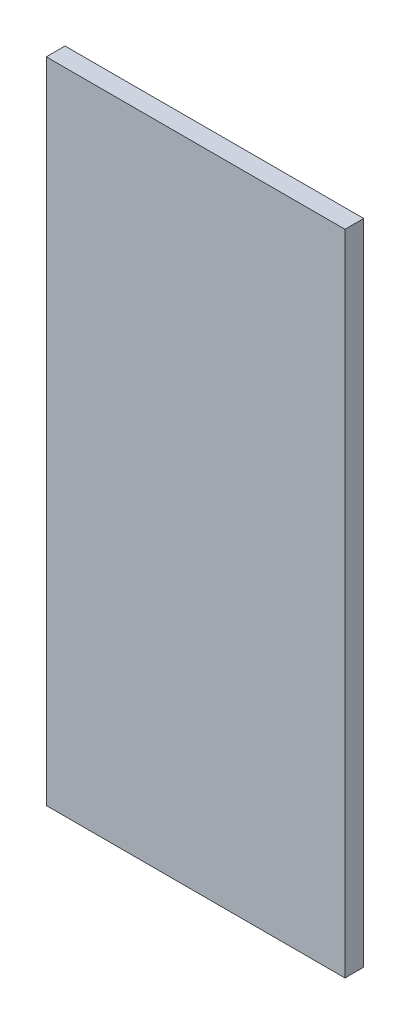
ISO-10303-21;
HEADER;
FILE_DESCRIPTION(('STEP AP214'),'2;1');
FILE_NAME('part.step','',(''),(''),'','','');
FILE_SCHEMA(('AUTOMOTIVE_DESIGN { 1 0 10303 214 1 1 1 1 }'));
ENDSEC;
DATA;
#1=APPLICATION_CONTEXT('core data for automotive mechanical design processes');
#2=APPLICATION_PROTOCOL_DEFINITION('international standard','automotive_design',2000,#1);
#3=PRODUCT_CONTEXT('',#1,'mechanical');
#4=PRODUCT('Part','Part','',(#3));
#5=PRODUCT_RELATED_PRODUCT_CATEGORY('part','',(#4));
#6=PRODUCT_DEFINITION_FORMATION('','',#4);
#7=PRODUCT_DEFINITION_CONTEXT('part definition',#1,'design');
#8=PRODUCT_DEFINITION('design','',#6,#7);
#9=PRODUCT_DEFINITION_SHAPE('','',#8);
#10=(LENGTH_UNIT() NAMED_UNIT(*) SI_UNIT(.MILLI.,.METRE.));
#11=(NAMED_UNIT(*) PLANE_ANGLE_UNIT() SI_UNIT($,.RADIAN.));
#12=(NAMED_UNIT(*) SI_UNIT($,.STERADIAN.) SOLID_ANGLE_UNIT());
#13=UNCERTAINTY_MEASURE_WITH_UNIT(LENGTH_MEASURE(1.E-05),#10,'distance_accuracy_value','');
#14=(GEOMETRIC_REPRESENTATION_CONTEXT(3) GLOBAL_UNCERTAINTY_ASSIGNED_CONTEXT((#13)) GLOBAL_UNIT_ASSIGNED_CONTEXT((#10,
#11,#12)) REPRESENTATION_CONTEXT('',''));
#15=CARTESIAN_POINT('',(0.,0.,0.));
#16=DIRECTION('',(0.,0.,1.));
#17=DIRECTION('',(1.,0.,0.));
#18=AXIS2_PLACEMENT_3D('',#15,#16,#17);
#19=CARTESIAN_POINT('',(-143.5,-311.5,18.));
#20=DIRECTION('',(1.,0.,0.));
#21=DIRECTION('',(0.,0.,-1.));
#22=AXIS2_PLACEMENT_3D('',#19,#20,#21);
#23=PLANE('',#22);
#24=DIRECTION('',(0.,-1.,0.));
#25=VECTOR('',#24,1.);
#26=CARTESIAN_POINT('',(-143.5,-311.5,0.));
#27=LINE('',#26,#25);
#28=CARTESIAN_POINT('',(-143.5,311.5,0.));
#29=VERTEX_POINT('',#28);
#30=CARTESIAN_POINT('',(-143.5,-311.5,0.));
#31=VERTEX_POINT('',#30);
#32=EDGE_CURVE('E96',#29,#31,#27,.T.);
#33=ORIENTED_EDGE('',*,*,#32,.T.);
#34=DIRECTION('',(0.,0.,-1.));
#35=VECTOR('',#34,1.);
#36=CARTESIAN_POINT('',(-143.5,-311.5,18.));
#37=LINE('',#36,#35);
#38=CARTESIAN_POINT('',(-143.5,-311.5,18.));
#39=VERTEX_POINT('',#38);
#40=EDGE_CURVE('E11',#39,#31,#37,.T.);
#41=ORIENTED_EDGE('',*,*,#40,.F.);
#42=DIRECTION('',(0.,-1.,0.));
#43=VECTOR('',#42,1.);
#44=CARTESIAN_POINT('',(-143.5,-311.5,18.));
#45=LINE('',#44,#43);
#46=CARTESIAN_POINT('',(-143.5,311.5,18.));
#47=VERTEX_POINT('',#46);
#48=EDGE_CURVE('E84',#47,#39,#45,.T.);
#49=ORIENTED_EDGE('',*,*,#48,.F.);
#50=DIRECTION('',(0.,0.,-1.));
#51=VECTOR('',#50,1.);
#52=CARTESIAN_POINT('',(-143.5,311.5,18.));
#53=LINE('',#52,#51);
#54=EDGE_CURVE('E92',#47,#29,#53,.T.);
#55=ORIENTED_EDGE('',*,*,#54,.T.);
#56=EDGE_LOOP('',(#33,#41,#49,#55));
#57=FACE_BOUND('',#56,.T.);
#58=ADVANCED_FACE('F33',(#57),#23,.F.);
#59=CARTESIAN_POINT('',(143.5,-311.5,18.));
#60=DIRECTION('',(0.,1.,0.));
#61=DIRECTION('',(0.,0.,1.));
#62=AXIS2_PLACEMENT_3D('',#59,#60,#61);
#63=PLANE('',#62);
#64=DIRECTION('',(1.,0.,0.));
#65=VECTOR('',#64,1.);
#66=CARTESIAN_POINT('',(143.5,-311.5,0.));
#67=LINE('',#66,#65);
#68=CARTESIAN_POINT('',(143.5,-311.5,0.));
#69=VERTEX_POINT('',#68);
#70=EDGE_CURVE('E88',#31,#69,#67,.T.);
#71=ORIENTED_EDGE('',*,*,#70,.T.);
#72=DIRECTION('',(0.,0.,-1.));
#73=VECTOR('',#72,1.);
#74=CARTESIAN_POINT('',(143.5,-311.5,18.));
#75=LINE('',#74,#73);
#76=CARTESIAN_POINT('',(143.5,-311.5,18.));
#77=VERTEX_POINT('',#76);
#78=EDGE_CURVE('E41',#77,#69,#75,.T.);
#79=ORIENTED_EDGE('',*,*,#78,.F.);
#80=DIRECTION('',(1.,0.,0.));
#81=VECTOR('',#80,1.);
#82=CARTESIAN_POINT('',(143.5,-311.5,18.));
#83=LINE('',#82,#81);
#84=EDGE_CURVE('E79',#39,#77,#83,.T.);
#85=ORIENTED_EDGE('',*,*,#84,.F.);
#86=ORIENTED_EDGE('',*,*,#40,.T.);
#87=EDGE_LOOP('',(#71,#79,#85,#86));
#88=FACE_BOUND('',#87,.T.);
#89=ADVANCED_FACE('F87',(#88),#63,.F.);
#90=CARTESIAN_POINT('',(143.5,-311.5,18.));
#91=DIRECTION('',(-1.,0.,0.));
#92=DIRECTION('',(0.,0.,1.));
#93=AXIS2_PLACEMENT_3D('',#90,#91,#92);
#94=PLANE('',#93);
#95=DIRECTION('',(0.,1.,0.));
#96=VECTOR('',#95,1.);
#97=CARTESIAN_POINT('',(143.5,-311.5,0.));
#98=LINE('',#97,#96);
#99=CARTESIAN_POINT('',(143.5,311.5,0.));
#100=VERTEX_POINT('',#99);
#101=EDGE_CURVE('E66',#69,#100,#98,.T.);
#102=ORIENTED_EDGE('',*,*,#101,.T.);
#103=DIRECTION('',(0.,0.,-1.));
#104=VECTOR('',#103,1.);
#105=CARTESIAN_POINT('',(143.5,311.5,18.));
#106=LINE('',#105,#104);
#107=CARTESIAN_POINT('',(143.5,311.5,18.));
#108=VERTEX_POINT('',#107);
#109=EDGE_CURVE('E89',#108,#100,#106,.T.);
#110=ORIENTED_EDGE('',*,*,#109,.F.);
#111=DIRECTION('',(0.,1.,0.));
#112=VECTOR('',#111,1.);
#113=CARTESIAN_POINT('',(143.5,-311.5,18.));
#114=LINE('',#113,#112);
#115=EDGE_CURVE('E82',#77,#108,#114,.T.);
#116=ORIENTED_EDGE('',*,*,#115,.F.);
#117=ORIENTED_EDGE('',*,*,#78,.T.);
#118=EDGE_LOOP('',(#102,#110,#116,#117));
#119=FACE_BOUND('',#118,.T.);
#120=ADVANCED_FACE('F90',(#119),#94,.F.);
#121=CARTESIAN_POINT('',(143.5,311.5,18.));
#122=DIRECTION('',(0.,-1.,0.));
#123=DIRECTION('',(0.,0.,-1.));
#124=AXIS2_PLACEMENT_3D('',#121,#122,#123);
#125=PLANE('',#124);
#126=DIRECTION('',(-1.,0.,0.));
#127=VECTOR('',#126,1.);
#128=CARTESIAN_POINT('',(143.5,311.5,0.));
#129=LINE('',#128,#127);
#130=EDGE_CURVE('E72',#100,#29,#129,.T.);
#131=ORIENTED_EDGE('',*,*,#130,.T.);
#132=ORIENTED_EDGE('',*,*,#54,.F.);
#133=DIRECTION('',(-1.,0.,0.));
#134=VECTOR('',#133,1.);
#135=CARTESIAN_POINT('',(143.5,311.5,18.));
#136=LINE('',#135,#134);
#137=EDGE_CURVE('E49',#108,#47,#136,.T.);
#138=ORIENTED_EDGE('',*,*,#137,.F.);
#139=ORIENTED_EDGE('',*,*,#109,.T.);
#140=EDGE_LOOP('',(#131,#132,#138,#139));
#141=FACE_BOUND('',#140,.T.);
#142=ADVANCED_FACE('F103',(#141),#125,.F.);
#143=CARTESIAN_POINT('',(0.,0.,18.));
#144=DIRECTION('',(0.,0.,1.));
#145=DIRECTION('',(1.,0.,0.));
#146=AXIS2_PLACEMENT_3D('',#143,#144,#145);
#147=PLANE('',#146);
#148=ORIENTED_EDGE('',*,*,#48,.T.);
#149=ORIENTED_EDGE('',*,*,#84,.T.);
#150=ORIENTED_EDGE('',*,*,#115,.T.);
#151=ORIENTED_EDGE('',*,*,#137,.T.);
#152=EDGE_LOOP('',(#148,#149,#150,#151));
#153=FACE_BOUND('',#152,.T.);
#154=ADVANCED_FACE('F80',(#153),#147,.T.);
#155=CARTESIAN_POINT('',(0.,0.,0.));
#156=DIRECTION('',(0.,0.,1.));
#157=DIRECTION('',(1.,0.,0.));
#158=AXIS2_PLACEMENT_3D('',#155,#156,#157);
#159=PLANE('',#158);
#160=ORIENTED_EDGE('',*,*,#32,.F.);
#161=ORIENTED_EDGE('',*,*,#130,.F.);
#162=ORIENTED_EDGE('',*,*,#101,.F.);
#163=ORIENTED_EDGE('',*,*,#70,.F.);
#164=EDGE_LOOP('',(#160,#161,#162,#163));
#165=FACE_BOUND('',#164,.T.);
#166=ADVANCED_FACE('F106',(#165),#159,.F.);
#167=CLOSED_SHELL('',(#58,#89,#120,#142,#154,#166));
#168=MANIFOLD_SOLID_BREP('B2',#167);
#169=ADVANCED_BREP_SHAPE_REPRESENTATION('',(#18,#168),#14);
#170=SHAPE_DEFINITION_REPRESENTATION(#9,#169);
ENDSEC;
END-ISO-10303-21;
